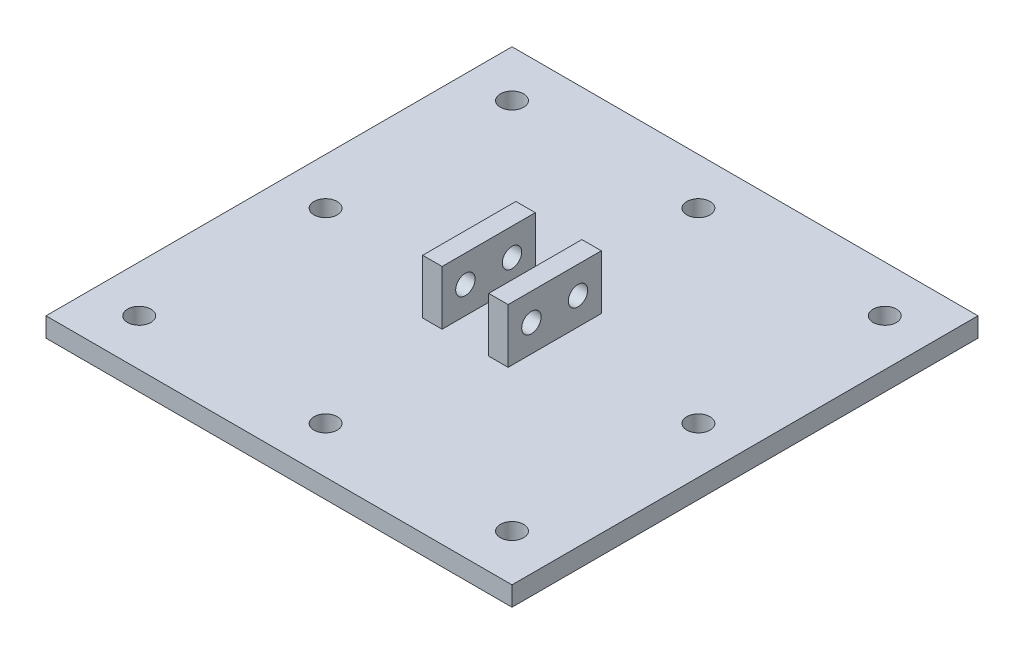
ISO-10303-21;
HEADER;
FILE_DESCRIPTION(('STEP AP214'),'2;1');
FILE_NAME('part.step','',(''),(''),'','','');
FILE_SCHEMA(('AUTOMOTIVE_DESIGN { 1 0 10303 214 1 1 1 1 }'));
ENDSEC;
DATA;
#1=APPLICATION_CONTEXT('core data for automotive mechanical design processes');
#2=APPLICATION_PROTOCOL_DEFINITION('international standard','automotive_design',2000,#1);
#3=PRODUCT_CONTEXT('',#1,'mechanical');
#4=PRODUCT('Part','Part','',(#3));
#5=PRODUCT_RELATED_PRODUCT_CATEGORY('part','',(#4));
#6=PRODUCT_DEFINITION_FORMATION('','',#4);
#7=PRODUCT_DEFINITION_CONTEXT('part definition',#1,'design');
#8=PRODUCT_DEFINITION('design','',#6,#7);
#9=PRODUCT_DEFINITION_SHAPE('','',#8);
#10=(LENGTH_UNIT() NAMED_UNIT(*) SI_UNIT(.MILLI.,.METRE.));
#11=(NAMED_UNIT(*) PLANE_ANGLE_UNIT() SI_UNIT($,.RADIAN.));
#12=(NAMED_UNIT(*) SI_UNIT($,.STERADIAN.) SOLID_ANGLE_UNIT());
#13=UNCERTAINTY_MEASURE_WITH_UNIT(LENGTH_MEASURE(1.E-05),#10,'distance_accuracy_value','');
#14=(GEOMETRIC_REPRESENTATION_CONTEXT(3) GLOBAL_UNCERTAINTY_ASSIGNED_CONTEXT((#13)) GLOBAL_UNIT_ASSIGNED_CONTEXT((#10,
#11,#12)) REPRESENTATION_CONTEXT('',''));
#15=CARTESIAN_POINT('',(0.,0.,0.));
#16=DIRECTION('',(0.,0.,1.));
#17=DIRECTION('',(1.,0.,0.));
#18=AXIS2_PLACEMENT_3D('',#15,#16,#17);
#19=CARTESIAN_POINT('',(0.,2.5,0.));
#20=DIRECTION('',(0.,-1.,0.));
#21=DIRECTION('',(0.,0.,-1.));
#22=AXIS2_PLACEMENT_3D('',#19,#20,#21);
#23=PLANE('',#22);
#24=CARTESIAN_POINT('',(-24.,2.5,24.));
#25=DIRECTION('',(0.,1.,0.));
#26=DIRECTION('',(0.,0.,1.));
#27=AXIS2_PLACEMENT_3D('',#24,#25,#26);
#28=CIRCLE('',#27,1.5);
#29=CARTESIAN_POINT('',(-24.,2.5,25.5));
#30=VERTEX_POINT('',#29);
#31=EDGE_CURVE('E507',#30,#30,#28,.T.);
#32=ORIENTED_EDGE('',*,*,#31,.F.);
#33=EDGE_LOOP('',(#32));
#34=FACE_BOUND('',#33,.T.);
#35=CARTESIAN_POINT('',(-24.,2.5,-24.));
#36=DIRECTION('',(0.,1.,0.));
#37=DIRECTION('',(0.,0.,1.));
#38=AXIS2_PLACEMENT_3D('',#35,#36,#37);
#39=CIRCLE('',#38,1.5);
#40=CARTESIAN_POINT('',(-24.,2.5,-22.5));
#41=VERTEX_POINT('',#40);
#42=EDGE_CURVE('E511',#41,#41,#39,.T.);
#43=ORIENTED_EDGE('',*,*,#42,.F.);
#44=EDGE_LOOP('',(#43));
#45=FACE_BOUND('',#44,.T.);
#46=CARTESIAN_POINT('',(24.,2.5,-24.));
#47=DIRECTION('',(0.,1.,0.));
#48=DIRECTION('',(0.,0.,1.));
#49=AXIS2_PLACEMENT_3D('',#46,#47,#48);
#50=CIRCLE('',#49,1.5);
#51=CARTESIAN_POINT('',(24.,2.5,-22.5));
#52=VERTEX_POINT('',#51);
#53=EDGE_CURVE('E522',#52,#52,#50,.T.);
#54=ORIENTED_EDGE('',*,*,#53,.F.);
#55=EDGE_LOOP('',(#54));
#56=FACE_BOUND('',#55,.T.);
#57=CARTESIAN_POINT('',(24.,2.5,0.));
#58=DIRECTION('',(0.,1.,0.));
#59=DIRECTION('',(0.,0.,1.));
#60=AXIS2_PLACEMENT_3D('',#57,#58,#59);
#61=CIRCLE('',#60,1.5);
#62=CARTESIAN_POINT('',(24.,2.5,1.5));
#63=VERTEX_POINT('',#62);
#64=EDGE_CURVE('E528',#63,#63,#61,.T.);
#65=ORIENTED_EDGE('',*,*,#64,.F.);
#66=EDGE_LOOP('',(#65));
#67=FACE_BOUND('',#66,.T.);
#68=CARTESIAN_POINT('',(-24.,2.5,0.));
#69=DIRECTION('',(0.,1.,0.));
#70=DIRECTION('',(0.,0.,1.));
#71=AXIS2_PLACEMENT_3D('',#68,#69,#70);
#72=CIRCLE('',#71,1.5);
#73=CARTESIAN_POINT('',(-24.,2.5,1.5));
#74=VERTEX_POINT('',#73);
#75=EDGE_CURVE('E534',#74,#74,#72,.T.);
#76=ORIENTED_EDGE('',*,*,#75,.F.);
#77=EDGE_LOOP('',(#76));
#78=FACE_BOUND('',#77,.T.);
#79=CARTESIAN_POINT('',(0.,2.5,24.));
#80=DIRECTION('',(0.,1.,0.));
#81=DIRECTION('',(0.,0.,1.));
#82=AXIS2_PLACEMENT_3D('',#79,#80,#81);
#83=CIRCLE('',#82,1.5);
#84=CARTESIAN_POINT('',(0.,2.5,25.5));
#85=VERTEX_POINT('',#84);
#86=EDGE_CURVE('E557',#85,#85,#83,.T.);
#87=ORIENTED_EDGE('',*,*,#86,.F.);
#88=EDGE_LOOP('',(#87));
#89=FACE_BOUND('',#88,.T.);
#90=CARTESIAN_POINT('',(0.,2.5,-24.));
#91=DIRECTION('',(0.,1.,0.));
#92=DIRECTION('',(0.,0.,1.));
#93=AXIS2_PLACEMENT_3D('',#90,#91,#92);
#94=CIRCLE('',#93,1.5);
#95=CARTESIAN_POINT('',(0.,2.5,-22.5));
#96=VERTEX_POINT('',#95);
#97=EDGE_CURVE('E564',#96,#96,#94,.T.);
#98=ORIENTED_EDGE('',*,*,#97,.F.);
#99=EDGE_LOOP('',(#98));
#100=FACE_BOUND('',#99,.T.);
#101=CARTESIAN_POINT('',(24.,2.5,24.));
#102=DIRECTION('',(0.,1.,0.));
#103=DIRECTION('',(0.,0.,1.));
#104=AXIS2_PLACEMENT_3D('',#101,#102,#103);
#105=CIRCLE('',#104,1.5);
#106=CARTESIAN_POINT('',(24.,2.5,25.5));
#107=VERTEX_POINT('',#106);
#108=EDGE_CURVE('E233',#107,#107,#105,.T.);
#109=ORIENTED_EDGE('',*,*,#108,.F.);
#110=EDGE_LOOP('',(#109));
#111=FACE_BOUND('',#110,.T.);
#112=DIRECTION('',(0.,0.,-1.));
#113=VECTOR('',#112,1.);
#114=CARTESIAN_POINT('',(-3.,2.5,6.));
#115=LINE('',#114,#113);
#116=CARTESIAN_POINT('',(-3.,2.5,6.));
#117=VERTEX_POINT('',#116);
#118=CARTESIAN_POINT('',(-3.,2.5,-6.));
#119=VERTEX_POINT('',#118);
#120=EDGE_CURVE('E149',#117,#119,#115,.T.);
#121=ORIENTED_EDGE('',*,*,#120,.F.);
#122=DIRECTION('',(1.,0.,0.));
#123=VECTOR('',#122,1.);
#124=CARTESIAN_POINT('',(-5.5,2.5,6.));
#125=LINE('',#124,#123);
#126=CARTESIAN_POINT('',(-5.5,2.5,6.));
#127=VERTEX_POINT('',#126);
#128=EDGE_CURVE('E162',#127,#117,#125,.T.);
#129=ORIENTED_EDGE('',*,*,#128,.F.);
#130=DIRECTION('',(0.,0.,1.));
#131=VECTOR('',#130,1.);
#132=CARTESIAN_POINT('',(-5.5,2.5,6.));
#133=LINE('',#132,#131);
#134=CARTESIAN_POINT('',(-5.5,2.5,-6.));
#135=VERTEX_POINT('',#134);
#136=EDGE_CURVE('E171',#135,#127,#133,.T.);
#137=ORIENTED_EDGE('',*,*,#136,.F.);
#138=DIRECTION('',(-1.,0.,0.));
#139=VECTOR('',#138,1.);
#140=CARTESIAN_POINT('',(-5.5,2.5,-6.));
#141=LINE('',#140,#139);
#142=EDGE_CURVE('E152',#119,#135,#141,.T.);
#143=ORIENTED_EDGE('',*,*,#142,.F.);
#144=EDGE_LOOP('',(#121,#129,#137,#143));
#145=FACE_BOUND('',#144,.T.);
#146=DIRECTION('',(0.,0.,-1.));
#147=VECTOR('',#146,1.);
#148=CARTESIAN_POINT('',(30.,2.5,30.));
#149=LINE('',#148,#147);
#150=CARTESIAN_POINT('',(30.,2.5,30.));
#151=VERTEX_POINT('',#150);
#152=CARTESIAN_POINT('',(30.,2.5,-30.));
#153=VERTEX_POINT('',#152);
#154=EDGE_CURVE('E188',#151,#153,#149,.T.);
#155=ORIENTED_EDGE('',*,*,#154,.T.);
#156=DIRECTION('',(-1.,0.,0.));
#157=VECTOR('',#156,1.);
#158=CARTESIAN_POINT('',(-30.,2.5,-30.));
#159=LINE('',#158,#157);
#160=CARTESIAN_POINT('',(-30.,2.5,-30.));
#161=VERTEX_POINT('',#160);
#162=EDGE_CURVE('E191',#153,#161,#159,.T.);
#163=ORIENTED_EDGE('',*,*,#162,.T.);
#164=DIRECTION('',(0.,0.,1.));
#165=VECTOR('',#164,1.);
#166=CARTESIAN_POINT('',(-30.,2.5,30.));
#167=LINE('',#166,#165);
#168=CARTESIAN_POINT('',(-30.,2.5,30.));
#169=VERTEX_POINT('',#168);
#170=EDGE_CURVE('E194',#161,#169,#167,.T.);
#171=ORIENTED_EDGE('',*,*,#170,.T.);
#172=DIRECTION('',(1.,0.,0.));
#173=VECTOR('',#172,1.);
#174=CARTESIAN_POINT('',(-30.,2.5,30.));
#175=LINE('',#174,#173);
#176=EDGE_CURVE('E196',#169,#151,#175,.T.);
#177=ORIENTED_EDGE('',*,*,#176,.T.);
#178=EDGE_LOOP('',(#155,#163,#171,#177));
#179=FACE_BOUND('',#178,.T.);
#180=DIRECTION('',(0.,0.,-1.));
#181=VECTOR('',#180,1.);
#182=CARTESIAN_POINT('',(5.5,2.5,6.));
#183=LINE('',#182,#181);
#184=CARTESIAN_POINT('',(5.5,2.5,6.));
#185=VERTEX_POINT('',#184);
#186=CARTESIAN_POINT('',(5.5,2.5,-6.));
#187=VERTEX_POINT('',#186);
#188=EDGE_CURVE('E148',#185,#187,#183,.T.);
#189=ORIENTED_EDGE('',*,*,#188,.F.);
#190=DIRECTION('',(1.,0.,0.));
#191=VECTOR('',#190,1.);
#192=CARTESIAN_POINT('',(3.,2.5,6.));
#193=LINE('',#192,#191);
#194=CARTESIAN_POINT('',(3.,2.5,6.));
#195=VERTEX_POINT('',#194);
#196=EDGE_CURVE('E145',#195,#185,#193,.T.);
#197=ORIENTED_EDGE('',*,*,#196,.F.);
#198=DIRECTION('',(0.,0.,1.));
#199=VECTOR('',#198,1.);
#200=CARTESIAN_POINT('',(3.,2.5,6.));
#201=LINE('',#200,#199);
#202=CARTESIAN_POINT('',(3.,2.5,-6.));
#203=VERTEX_POINT('',#202);
#204=EDGE_CURVE('E59',#203,#195,#201,.T.);
#205=ORIENTED_EDGE('',*,*,#204,.F.);
#206=DIRECTION('',(-1.,0.,0.));
#207=VECTOR('',#206,1.);
#208=CARTESIAN_POINT('',(3.,2.5,-6.));
#209=LINE('',#208,#207);
#210=EDGE_CURVE('E54',#187,#203,#209,.T.);
#211=ORIENTED_EDGE('',*,*,#210,.F.);
#212=EDGE_LOOP('',(#189,#197,#205,#211));
#213=FACE_BOUND('',#212,.T.);
#214=ADVANCED_FACE('F37',(#34,#45,#56,#67,#78,#89,#100,#111,#145,#179,#213),#23,.F.);
#215=CARTESIAN_POINT('',(30.,2.5,30.));
#216=DIRECTION('',(-1.,0.,0.));
#217=DIRECTION('',(0.,0.,1.));
#218=AXIS2_PLACEMENT_3D('',#215,#216,#217);
#219=PLANE('',#218);
#220=DIRECTION('',(0.,0.,-1.));
#221=VECTOR('',#220,1.);
#222=CARTESIAN_POINT('',(30.,0.,30.));
#223=LINE('',#222,#221);
#224=CARTESIAN_POINT('',(30.,0.,30.));
#225=VERTEX_POINT('',#224);
#226=CARTESIAN_POINT('',(30.,0.,-30.));
#227=VERTEX_POINT('',#226);
#228=EDGE_CURVE('E187',#225,#227,#223,.T.);
#229=ORIENTED_EDGE('',*,*,#228,.T.);
#230=DIRECTION('',(0.,-1.,0.));
#231=VECTOR('',#230,1.);
#232=CARTESIAN_POINT('',(30.,2.5,-30.));
#233=LINE('',#232,#231);
#234=EDGE_CURVE('E11',#153,#227,#233,.T.);
#235=ORIENTED_EDGE('',*,*,#234,.F.);
#236=ORIENTED_EDGE('',*,*,#154,.F.);
#237=DIRECTION('',(0.,-1.,0.));
#238=VECTOR('',#237,1.);
#239=CARTESIAN_POINT('',(30.,2.5,30.));
#240=LINE('',#239,#238);
#241=EDGE_CURVE('E198',#151,#225,#240,.T.);
#242=ORIENTED_EDGE('',*,*,#241,.T.);
#243=EDGE_LOOP('',(#229,#235,#236,#242));
#244=FACE_BOUND('',#243,.T.);
#245=ADVANCED_FACE('F39',(#244),#219,.F.);
#246=CARTESIAN_POINT('',(-30.,2.5,-30.));
#247=DIRECTION('',(0.,0.,1.));
#248=DIRECTION('',(1.,0.,0.));
#249=AXIS2_PLACEMENT_3D('',#246,#247,#248);
#250=PLANE('',#249);
#251=DIRECTION('',(-1.,0.,0.));
#252=VECTOR('',#251,1.);
#253=CARTESIAN_POINT('',(-30.,0.,-30.));
#254=LINE('',#253,#252);
#255=CARTESIAN_POINT('',(-30.,0.,-30.));
#256=VERTEX_POINT('',#255);
#257=EDGE_CURVE('E201',#227,#256,#254,.T.);
#258=ORIENTED_EDGE('',*,*,#257,.T.);
#259=DIRECTION('',(0.,-1.,0.));
#260=VECTOR('',#259,1.);
#261=CARTESIAN_POINT('',(-30.,2.5,-30.));
#262=LINE('',#261,#260);
#263=EDGE_CURVE('E46',#161,#256,#262,.T.);
#264=ORIENTED_EDGE('',*,*,#263,.F.);
#265=ORIENTED_EDGE('',*,*,#162,.F.);
#266=ORIENTED_EDGE('',*,*,#234,.T.);
#267=EDGE_LOOP('',(#258,#264,#265,#266));
#268=FACE_BOUND('',#267,.T.);
#269=ADVANCED_FACE('F269',(#268),#250,.F.);
#270=CARTESIAN_POINT('',(-30.,2.5,30.));
#271=DIRECTION('',(1.,0.,0.));
#272=DIRECTION('',(0.,0.,-1.));
#273=AXIS2_PLACEMENT_3D('',#270,#271,#272);
#274=PLANE('',#273);
#275=DIRECTION('',(0.,0.,1.));
#276=VECTOR('',#275,1.);
#277=CARTESIAN_POINT('',(-30.,0.,30.));
#278=LINE('',#277,#276);
#279=CARTESIAN_POINT('',(-30.,0.,30.));
#280=VERTEX_POINT('',#279);
#281=EDGE_CURVE('E203',#256,#280,#278,.T.);
#282=ORIENTED_EDGE('',*,*,#281,.T.);
#283=DIRECTION('',(0.,-1.,0.));
#284=VECTOR('',#283,1.);
#285=CARTESIAN_POINT('',(-30.,2.5,30.));
#286=LINE('',#285,#284);
#287=EDGE_CURVE('E208',#169,#280,#286,.T.);
#288=ORIENTED_EDGE('',*,*,#287,.F.);
#289=ORIENTED_EDGE('',*,*,#170,.F.);
#290=ORIENTED_EDGE('',*,*,#263,.T.);
#291=EDGE_LOOP('',(#282,#288,#289,#290));
#292=FACE_BOUND('',#291,.T.);
#293=ADVANCED_FACE('F284',(#292),#274,.F.);
#294=CARTESIAN_POINT('',(-30.,2.5,30.));
#295=DIRECTION('',(0.,0.,-1.));
#296=DIRECTION('',(-1.,0.,0.));
#297=AXIS2_PLACEMENT_3D('',#294,#295,#296);
#298=PLANE('',#297);
#299=DIRECTION('',(1.,0.,0.));
#300=VECTOR('',#299,1.);
#301=CARTESIAN_POINT('',(-30.,0.,30.));
#302=LINE('',#301,#300);
#303=EDGE_CURVE('E192',#280,#225,#302,.T.);
#304=ORIENTED_EDGE('',*,*,#303,.T.);
#305=ORIENTED_EDGE('',*,*,#241,.F.);
#306=ORIENTED_EDGE('',*,*,#176,.F.);
#307=ORIENTED_EDGE('',*,*,#287,.T.);
#308=EDGE_LOOP('',(#304,#305,#306,#307));
#309=FACE_BOUND('',#308,.T.);
#310=ADVANCED_FACE('F280',(#309),#298,.F.);
#311=CARTESIAN_POINT('',(0.,0.,0.));
#312=DIRECTION('',(0.,-1.,0.));
#313=DIRECTION('',(0.,0.,-1.));
#314=AXIS2_PLACEMENT_3D('',#311,#312,#313);
#315=PLANE('',#314);
#316=CARTESIAN_POINT('',(-24.,0.,24.));
#317=DIRECTION('',(0.,-1.,0.));
#318=DIRECTION('',(0.,0.,-1.));
#319=AXIS2_PLACEMENT_3D('',#316,#317,#318);
#320=CIRCLE('',#319,1.5);
#321=CARTESIAN_POINT('',(-24.,0.,22.5));
#322=VERTEX_POINT('',#321);
#323=EDGE_CURVE('E505',#322,#322,#320,.F.);
#324=ORIENTED_EDGE('',*,*,#323,.T.);
#325=EDGE_LOOP('',(#324));
#326=FACE_BOUND('',#325,.T.);
#327=CARTESIAN_POINT('',(-24.,0.,-24.));
#328=DIRECTION('',(0.,-1.,0.));
#329=DIRECTION('',(0.,0.,-1.));
#330=AXIS2_PLACEMENT_3D('',#327,#328,#329);
#331=CIRCLE('',#330,1.5);
#332=CARTESIAN_POINT('',(-24.,0.,-25.5));
#333=VERTEX_POINT('',#332);
#334=EDGE_CURVE('E519',#333,#333,#331,.F.);
#335=ORIENTED_EDGE('',*,*,#334,.T.);
#336=EDGE_LOOP('',(#335));
#337=FACE_BOUND('',#336,.T.);
#338=CARTESIAN_POINT('',(24.,0.,-24.));
#339=DIRECTION('',(0.,-1.,0.));
#340=DIRECTION('',(0.,0.,-1.));
#341=AXIS2_PLACEMENT_3D('',#338,#339,#340);
#342=CIRCLE('',#341,1.5);
#343=CARTESIAN_POINT('',(24.,0.,-25.5));
#344=VERTEX_POINT('',#343);
#345=EDGE_CURVE('E525',#344,#344,#342,.F.);
#346=ORIENTED_EDGE('',*,*,#345,.T.);
#347=EDGE_LOOP('',(#346));
#348=FACE_BOUND('',#347,.T.);
#349=CARTESIAN_POINT('',(24.,0.,0.));
#350=DIRECTION('',(0.,-1.,0.));
#351=DIRECTION('',(0.,0.,-1.));
#352=AXIS2_PLACEMENT_3D('',#349,#350,#351);
#353=CIRCLE('',#352,1.5);
#354=CARTESIAN_POINT('',(24.,0.,-1.5));
#355=VERTEX_POINT('',#354);
#356=EDGE_CURVE('E531',#355,#355,#353,.F.);
#357=ORIENTED_EDGE('',*,*,#356,.T.);
#358=EDGE_LOOP('',(#357));
#359=FACE_BOUND('',#358,.T.);
#360=CARTESIAN_POINT('',(-24.,0.,0.));
#361=DIRECTION('',(0.,-1.,0.));
#362=DIRECTION('',(0.,0.,-1.));
#363=AXIS2_PLACEMENT_3D('',#360,#361,#362);
#364=CIRCLE('',#363,1.5);
#365=CARTESIAN_POINT('',(-24.,0.,-1.5));
#366=VERTEX_POINT('',#365);
#367=EDGE_CURVE('E552',#366,#366,#364,.F.);
#368=ORIENTED_EDGE('',*,*,#367,.T.);
#369=EDGE_LOOP('',(#368));
#370=FACE_BOUND('',#369,.T.);
#371=CARTESIAN_POINT('',(0.,0.,24.));
#372=DIRECTION('',(0.,-1.,0.));
#373=DIRECTION('',(0.,0.,-1.));
#374=AXIS2_PLACEMENT_3D('',#371,#372,#373);
#375=CIRCLE('',#374,1.5);
#376=CARTESIAN_POINT('',(0.,0.,22.5));
#377=VERTEX_POINT('',#376);
#378=EDGE_CURVE('E562',#377,#377,#375,.F.);
#379=ORIENTED_EDGE('',*,*,#378,.T.);
#380=EDGE_LOOP('',(#379));
#381=FACE_BOUND('',#380,.T.);
#382=CARTESIAN_POINT('',(0.,0.,-24.));
#383=DIRECTION('',(0.,-1.,0.));
#384=DIRECTION('',(0.,0.,-1.));
#385=AXIS2_PLACEMENT_3D('',#382,#383,#384);
#386=CIRCLE('',#385,1.5);
#387=CARTESIAN_POINT('',(0.,0.,-25.5));
#388=VERTEX_POINT('',#387);
#389=EDGE_CURVE('E514',#388,#388,#386,.F.);
#390=ORIENTED_EDGE('',*,*,#389,.T.);
#391=EDGE_LOOP('',(#390));
#392=FACE_BOUND('',#391,.T.);
#393=CARTESIAN_POINT('',(24.,0.,24.));
#394=DIRECTION('',(0.,-1.,0.));
#395=DIRECTION('',(0.,0.,-1.));
#396=AXIS2_PLACEMENT_3D('',#393,#394,#395);
#397=CIRCLE('',#396,1.5);
#398=CARTESIAN_POINT('',(24.,0.,22.5));
#399=VERTEX_POINT('',#398);
#400=EDGE_CURVE('E508',#399,#399,#397,.F.);
#401=ORIENTED_EDGE('',*,*,#400,.T.);
#402=EDGE_LOOP('',(#401));
#403=FACE_BOUND('',#402,.T.);
#404=ORIENTED_EDGE('',*,*,#228,.F.);
#405=ORIENTED_EDGE('',*,*,#303,.F.);
#406=ORIENTED_EDGE('',*,*,#281,.F.);
#407=ORIENTED_EDGE('',*,*,#257,.F.);
#408=EDGE_LOOP('',(#404,#405,#406,#407));
#409=FACE_BOUND('',#408,.T.);
#410=ADVANCED_FACE('F277',(#326,#337,#348,#359,#370,#381,#392,#403,#409),#315,.T.);
#411=CARTESIAN_POINT('',(-3.,9.5,6.));
#412=DIRECTION('',(-1.,0.,0.));
#413=DIRECTION('',(0.,0.,1.));
#414=AXIS2_PLACEMENT_3D('',#411,#412,#413);
#415=PLANE('',#414);
#416=CARTESIAN_POINT('',(-3.,6.,-3.));
#417=DIRECTION('',(-1.,0.,0.));
#418=DIRECTION('',(0.,0.,1.));
#419=AXIS2_PLACEMENT_3D('',#416,#417,#418);
#420=CIRCLE('',#419,1.25);
#421=CARTESIAN_POINT('',(-3.,6.,-1.75));
#422=VERTEX_POINT('',#421);
#423=EDGE_CURVE('E236',#422,#422,#420,.T.);
#424=ORIENTED_EDGE('',*,*,#423,.T.);
#425=EDGE_LOOP('',(#424));
#426=FACE_BOUND('',#425,.T.);
#427=CARTESIAN_POINT('',(-3.,6.,3.));
#428=DIRECTION('',(-1.,0.,0.));
#429=DIRECTION('',(0.,0.,1.));
#430=AXIS2_PLACEMENT_3D('',#427,#428,#429);
#431=CIRCLE('',#430,1.25);
#432=CARTESIAN_POINT('',(-3.,6.,4.25));
#433=VERTEX_POINT('',#432);
#434=EDGE_CURVE('E214',#433,#433,#431,.T.);
#435=ORIENTED_EDGE('',*,*,#434,.T.);
#436=EDGE_LOOP('',(#435));
#437=FACE_BOUND('',#436,.T.);
#438=ORIENTED_EDGE('',*,*,#120,.T.);
#439=DIRECTION('',(0.,-1.,0.));
#440=VECTOR('',#439,1.);
#441=CARTESIAN_POINT('',(-3.,9.5,-6.));
#442=LINE('',#441,#440);
#443=CARTESIAN_POINT('',(-3.,9.5,-6.));
#444=VERTEX_POINT('',#443);
#445=EDGE_CURVE('E184',#444,#119,#442,.T.);
#446=ORIENTED_EDGE('',*,*,#445,.F.);
#447=DIRECTION('',(0.,0.,-1.));
#448=VECTOR('',#447,1.);
#449=CARTESIAN_POINT('',(-3.,9.5,6.));
#450=LINE('',#449,#448);
#451=CARTESIAN_POINT('',(-3.,9.5,6.));
#452=VERTEX_POINT('',#451);
#453=EDGE_CURVE('E158',#452,#444,#450,.T.);
#454=ORIENTED_EDGE('',*,*,#453,.F.);
#455=DIRECTION('',(0.,-1.,0.));
#456=VECTOR('',#455,1.);
#457=CARTESIAN_POINT('',(-3.,9.5,6.));
#458=LINE('',#457,#456);
#459=EDGE_CURVE('E167',#452,#117,#458,.T.);
#460=ORIENTED_EDGE('',*,*,#459,.T.);
#461=EDGE_LOOP('',(#438,#446,#454,#460));
#462=FACE_BOUND('',#461,.T.);
#463=ADVANCED_FACE('F275',(#426,#437,#462),#415,.F.);
#464=CARTESIAN_POINT('',(-5.5,9.5,-6.));
#465=DIRECTION('',(0.,0.,1.));
#466=DIRECTION('',(1.,0.,0.));
#467=AXIS2_PLACEMENT_3D('',#464,#465,#466);
#468=PLANE('',#467);
#469=ORIENTED_EDGE('',*,*,#142,.T.);
#470=DIRECTION('',(0.,-1.,0.));
#471=VECTOR('',#470,1.);
#472=CARTESIAN_POINT('',(-5.5,9.5,-6.));
#473=LINE('',#472,#471);
#474=CARTESIAN_POINT('',(-5.5,9.5,-6.));
#475=VERTEX_POINT('',#474);
#476=EDGE_CURVE('E181',#475,#135,#473,.T.);
#477=ORIENTED_EDGE('',*,*,#476,.F.);
#478=DIRECTION('',(-1.,0.,0.));
#479=VECTOR('',#478,1.);
#480=CARTESIAN_POINT('',(-5.5,9.5,-6.));
#481=LINE('',#480,#479);
#482=EDGE_CURVE('E161',#444,#475,#481,.T.);
#483=ORIENTED_EDGE('',*,*,#482,.F.);
#484=ORIENTED_EDGE('',*,*,#445,.T.);
#485=EDGE_LOOP('',(#469,#477,#483,#484));
#486=FACE_BOUND('',#485,.T.);
#487=ADVANCED_FACE('F326',(#486),#468,.F.);
#488=CARTESIAN_POINT('',(-5.5,9.5,6.));
#489=DIRECTION('',(1.,0.,0.));
#490=DIRECTION('',(0.,0.,-1.));
#491=AXIS2_PLACEMENT_3D('',#488,#489,#490);
#492=PLANE('',#491);
#493=CARTESIAN_POINT('',(-5.5,6.,-3.));
#494=DIRECTION('',(-1.,0.,0.));
#495=DIRECTION('',(0.,0.,1.));
#496=AXIS2_PLACEMENT_3D('',#493,#494,#495);
#497=CIRCLE('',#496,1.25);
#498=CARTESIAN_POINT('',(-5.5,6.,-1.75));
#499=VERTEX_POINT('',#498);
#500=EDGE_CURVE('E221',#499,#499,#497,.T.);
#501=ORIENTED_EDGE('',*,*,#500,.F.);
#502=EDGE_LOOP('',(#501));
#503=FACE_BOUND('',#502,.T.);
#504=CARTESIAN_POINT('',(-5.5,6.,3.));
#505=DIRECTION('',(-1.,0.,0.));
#506=DIRECTION('',(0.,0.,1.));
#507=AXIS2_PLACEMENT_3D('',#504,#505,#506);
#508=CIRCLE('',#507,1.25);
#509=CARTESIAN_POINT('',(-5.5,6.,4.25));
#510=VERTEX_POINT('',#509);
#511=EDGE_CURVE('E230',#510,#510,#508,.T.);
#512=ORIENTED_EDGE('',*,*,#511,.F.);
#513=EDGE_LOOP('',(#512));
#514=FACE_BOUND('',#513,.T.);
#515=ORIENTED_EDGE('',*,*,#136,.T.);
#516=DIRECTION('',(0.,-1.,0.));
#517=VECTOR('',#516,1.);
#518=CARTESIAN_POINT('',(-5.5,9.5,6.));
#519=LINE('',#518,#517);
#520=CARTESIAN_POINT('',(-5.5,9.5,6.));
#521=VERTEX_POINT('',#520);
#522=EDGE_CURVE('E178',#521,#127,#519,.T.);
#523=ORIENTED_EDGE('',*,*,#522,.F.);
#524=DIRECTION('',(0.,0.,1.));
#525=VECTOR('',#524,1.);
#526=CARTESIAN_POINT('',(-5.5,9.5,6.));
#527=LINE('',#526,#525);
#528=EDGE_CURVE('E164',#475,#521,#527,.T.);
#529=ORIENTED_EDGE('',*,*,#528,.F.);
#530=ORIENTED_EDGE('',*,*,#476,.T.);
#531=EDGE_LOOP('',(#515,#523,#529,#530));
#532=FACE_BOUND('',#531,.T.);
#533=ADVANCED_FACE('F334',(#503,#514,#532),#492,.F.);
#534=CARTESIAN_POINT('',(-5.5,9.5,6.));
#535=DIRECTION('',(0.,0.,-1.));
#536=DIRECTION('',(-1.,0.,0.));
#537=AXIS2_PLACEMENT_3D('',#534,#535,#536);
#538=PLANE('',#537);
#539=ORIENTED_EDGE('',*,*,#128,.T.);
#540=ORIENTED_EDGE('',*,*,#459,.F.);
#541=DIRECTION('',(1.,0.,0.));
#542=VECTOR('',#541,1.);
#543=CARTESIAN_POINT('',(-5.5,9.5,6.));
#544=LINE('',#543,#542);
#545=EDGE_CURVE('E166',#521,#452,#544,.T.);
#546=ORIENTED_EDGE('',*,*,#545,.F.);
#547=ORIENTED_EDGE('',*,*,#522,.T.);
#548=EDGE_LOOP('',(#539,#540,#546,#547));
#549=FACE_BOUND('',#548,.T.);
#550=ADVANCED_FACE('F341',(#549),#538,.F.);
#551=CARTESIAN_POINT('',(0.,9.5,0.));
#552=DIRECTION('',(0.,-1.,0.));
#553=DIRECTION('',(0.,0.,-1.));
#554=AXIS2_PLACEMENT_3D('',#551,#552,#553);
#555=PLANE('',#554);
#556=ORIENTED_EDGE('',*,*,#453,.T.);
#557=ORIENTED_EDGE('',*,*,#482,.T.);
#558=ORIENTED_EDGE('',*,*,#528,.T.);
#559=ORIENTED_EDGE('',*,*,#545,.T.);
#560=EDGE_LOOP('',(#556,#557,#558,#559));
#561=FACE_BOUND('',#560,.T.);
#562=ADVANCED_FACE('F349',(#561),#555,.F.);
#563=CARTESIAN_POINT('',(5.5,9.5,6.));
#564=DIRECTION('',(-1.,0.,0.));
#565=DIRECTION('',(0.,0.,1.));
#566=AXIS2_PLACEMENT_3D('',#563,#564,#565);
#567=PLANE('',#566);
#568=CARTESIAN_POINT('',(5.5,6.,-3.));
#569=DIRECTION('',(-1.,0.,0.));
#570=DIRECTION('',(0.,0.,1.));
#571=AXIS2_PLACEMENT_3D('',#568,#569,#570);
#572=CIRCLE('',#571,1.25);
#573=CARTESIAN_POINT('',(5.5,6.,-1.75));
#574=VERTEX_POINT('',#573);
#575=EDGE_CURVE('E215',#574,#574,#572,.F.);
#576=ORIENTED_EDGE('',*,*,#575,.F.);
#577=EDGE_LOOP('',(#576));
#578=FACE_BOUND('',#577,.T.);
#579=CARTESIAN_POINT('',(5.5,6.,3.));
#580=DIRECTION('',(-1.,0.,0.));
#581=DIRECTION('',(0.,0.,1.));
#582=AXIS2_PLACEMENT_3D('',#579,#580,#581);
#583=CIRCLE('',#582,1.25);
#584=CARTESIAN_POINT('',(5.5,6.,4.25));
#585=VERTEX_POINT('',#584);
#586=EDGE_CURVE('E226',#585,#585,#583,.F.);
#587=ORIENTED_EDGE('',*,*,#586,.F.);
#588=EDGE_LOOP('',(#587));
#589=FACE_BOUND('',#588,.T.);
#590=ORIENTED_EDGE('',*,*,#188,.T.);
#591=DIRECTION('',(0.,-1.,0.));
#592=VECTOR('',#591,1.);
#593=CARTESIAN_POINT('',(5.5,9.5,-6.));
#594=LINE('',#593,#592);
#595=CARTESIAN_POINT('',(5.5,9.5,-6.));
#596=VERTEX_POINT('',#595);
#597=EDGE_CURVE('E129',#596,#187,#594,.T.);
#598=ORIENTED_EDGE('',*,*,#597,.F.);
#599=DIRECTION('',(0.,0.,-1.));
#600=VECTOR('',#599,1.);
#601=CARTESIAN_POINT('',(5.5,9.5,6.));
#602=LINE('',#601,#600);
#603=CARTESIAN_POINT('',(5.5,9.5,6.));
#604=VERTEX_POINT('',#603);
#605=EDGE_CURVE('E136',#604,#596,#602,.T.);
#606=ORIENTED_EDGE('',*,*,#605,.F.);
#607=DIRECTION('',(0.,-1.,0.));
#608=VECTOR('',#607,1.);
#609=CARTESIAN_POINT('',(5.5,9.5,6.));
#610=LINE('',#609,#608);
#611=EDGE_CURVE('E241',#604,#185,#610,.T.);
#612=ORIENTED_EDGE('',*,*,#611,.T.);
#613=EDGE_LOOP('',(#590,#598,#606,#612));
#614=FACE_BOUND('',#613,.T.);
#615=ADVANCED_FACE('F147',(#578,#589,#614),#567,.F.);
#616=CARTESIAN_POINT('',(3.,9.5,-6.));
#617=DIRECTION('',(0.,0.,1.));
#618=DIRECTION('',(1.,0.,0.));
#619=AXIS2_PLACEMENT_3D('',#616,#617,#618);
#620=PLANE('',#619);
#621=ORIENTED_EDGE('',*,*,#210,.T.);
#622=DIRECTION('',(0.,-1.,0.));
#623=VECTOR('',#622,1.);
#624=CARTESIAN_POINT('',(3.,9.5,-6.));
#625=LINE('',#624,#623);
#626=CARTESIAN_POINT('',(3.,9.5,-6.));
#627=VERTEX_POINT('',#626);
#628=EDGE_CURVE('E132',#627,#203,#625,.T.);
#629=ORIENTED_EDGE('',*,*,#628,.F.);
#630=DIRECTION('',(-1.,0.,0.));
#631=VECTOR('',#630,1.);
#632=CARTESIAN_POINT('',(3.,9.5,-6.));
#633=LINE('',#632,#631);
#634=EDGE_CURVE('E125',#596,#627,#633,.T.);
#635=ORIENTED_EDGE('',*,*,#634,.F.);
#636=ORIENTED_EDGE('',*,*,#597,.T.);
#637=EDGE_LOOP('',(#621,#629,#635,#636));
#638=FACE_BOUND('',#637,.T.);
#639=ADVANCED_FACE('F127',(#638),#620,.F.);
#640=CARTESIAN_POINT('',(3.,9.5,6.));
#641=DIRECTION('',(1.,0.,0.));
#642=DIRECTION('',(0.,0.,-1.));
#643=AXIS2_PLACEMENT_3D('',#640,#641,#642);
#644=PLANE('',#643);
#645=CARTESIAN_POINT('',(3.,6.,-3.));
#646=DIRECTION('',(1.,0.,0.));
#647=DIRECTION('',(0.,0.,-1.));
#648=AXIS2_PLACEMENT_3D('',#645,#646,#647);
#649=CIRCLE('',#648,1.25);
#650=CARTESIAN_POINT('',(3.,6.,-4.25));
#651=VERTEX_POINT('',#650);
#652=EDGE_CURVE('E41',#651,#651,#649,.T.);
#653=ORIENTED_EDGE('',*,*,#652,.T.);
#654=EDGE_LOOP('',(#653));
#655=FACE_BOUND('',#654,.T.);
#656=CARTESIAN_POINT('',(3.,6.,3.));
#657=DIRECTION('',(1.,0.,0.));
#658=DIRECTION('',(0.,0.,-1.));
#659=AXIS2_PLACEMENT_3D('',#656,#657,#658);
#660=CIRCLE('',#659,1.25);
#661=CARTESIAN_POINT('',(3.,6.,1.75));
#662=VERTEX_POINT('',#661);
#663=EDGE_CURVE('E212',#662,#662,#660,.T.);
#664=ORIENTED_EDGE('',*,*,#663,.T.);
#665=EDGE_LOOP('',(#664));
#666=FACE_BOUND('',#665,.T.);
#667=ORIENTED_EDGE('',*,*,#204,.T.);
#668=DIRECTION('',(0.,-1.,0.));
#669=VECTOR('',#668,1.);
#670=CARTESIAN_POINT('',(3.,9.5,6.));
#671=LINE('',#670,#669);
#672=CARTESIAN_POINT('',(3.,9.5,6.));
#673=VERTEX_POINT('',#672);
#674=EDGE_CURVE('E154',#673,#195,#671,.T.);
#675=ORIENTED_EDGE('',*,*,#674,.F.);
#676=DIRECTION('',(0.,0.,1.));
#677=VECTOR('',#676,1.);
#678=CARTESIAN_POINT('',(3.,9.5,6.));
#679=LINE('',#678,#677);
#680=EDGE_CURVE('E135',#627,#673,#679,.T.);
#681=ORIENTED_EDGE('',*,*,#680,.F.);
#682=ORIENTED_EDGE('',*,*,#628,.T.);
#683=EDGE_LOOP('',(#667,#675,#681,#682));
#684=FACE_BOUND('',#683,.T.);
#685=ADVANCED_FACE('F252',(#655,#666,#684),#644,.F.);
#686=CARTESIAN_POINT('',(3.,9.5,6.));
#687=DIRECTION('',(0.,0.,-1.));
#688=DIRECTION('',(-1.,0.,0.));
#689=AXIS2_PLACEMENT_3D('',#686,#687,#688);
#690=PLANE('',#689);
#691=ORIENTED_EDGE('',*,*,#196,.T.);
#692=ORIENTED_EDGE('',*,*,#611,.F.);
#693=DIRECTION('',(1.,0.,0.));
#694=VECTOR('',#693,1.);
#695=CARTESIAN_POINT('',(3.,9.5,6.));
#696=LINE('',#695,#694);
#697=EDGE_CURVE('E141',#673,#604,#696,.T.);
#698=ORIENTED_EDGE('',*,*,#697,.F.);
#699=ORIENTED_EDGE('',*,*,#674,.T.);
#700=EDGE_LOOP('',(#691,#692,#698,#699));
#701=FACE_BOUND('',#700,.T.);
#702=ADVANCED_FACE('F250',(#701),#690,.F.);
#703=CARTESIAN_POINT('',(0.,9.5,0.));
#704=DIRECTION('',(0.,-1.,0.));
#705=DIRECTION('',(0.,0.,-1.));
#706=AXIS2_PLACEMENT_3D('',#703,#704,#705);
#707=PLANE('',#706);
#708=ORIENTED_EDGE('',*,*,#605,.T.);
#709=ORIENTED_EDGE('',*,*,#634,.T.);
#710=ORIENTED_EDGE('',*,*,#680,.T.);
#711=ORIENTED_EDGE('',*,*,#697,.T.);
#712=EDGE_LOOP('',(#708,#709,#710,#711));
#713=FACE_BOUND('',#712,.T.);
#714=ADVANCED_FACE('F139',(#713),#707,.F.);
#715=CARTESIAN_POINT('',(9.03553390593274,6.,3.));
#716=DIRECTION('',(-1.,0.,0.));
#717=DIRECTION('',(0.,0.,1.));
#718=AXIS2_PLACEMENT_3D('',#715,#716,#717);
#719=CYLINDRICAL_SURFACE('',#718,1.25);
#720=ORIENTED_EDGE('',*,*,#586,.T.);
#721=EDGE_LOOP('',(#720));
#722=FACE_BOUND('',#721,.T.);
#723=ORIENTED_EDGE('',*,*,#663,.F.);
#724=EDGE_LOOP('',(#723));
#725=FACE_BOUND('',#724,.T.);
#726=ADVANCED_FACE('F382',(#722,#725),#719,.F.);
#727=CARTESIAN_POINT('',(9.03553390593274,6.,-3.));
#728=DIRECTION('',(-1.,0.,0.));
#729=DIRECTION('',(0.,0.,1.));
#730=AXIS2_PLACEMENT_3D('',#727,#728,#729);
#731=CYLINDRICAL_SURFACE('',#730,1.25);
#732=ORIENTED_EDGE('',*,*,#575,.T.);
#733=EDGE_LOOP('',(#732));
#734=FACE_BOUND('',#733,.T.);
#735=ORIENTED_EDGE('',*,*,#652,.F.);
#736=EDGE_LOOP('',(#735));
#737=FACE_BOUND('',#736,.T.);
#738=ADVANCED_FACE('F392',(#734,#737),#731,.F.);
#739=ORIENTED_EDGE('',*,*,#511,.T.);
#740=EDGE_LOOP('',(#739));
#741=FACE_BOUND('',#740,.T.);
#742=ORIENTED_EDGE('',*,*,#434,.F.);
#743=EDGE_LOOP('',(#742));
#744=FACE_BOUND('',#743,.T.);
#745=ADVANCED_FACE('F395',(#741,#744),#719,.F.);
#746=ORIENTED_EDGE('',*,*,#500,.T.);
#747=EDGE_LOOP('',(#746));
#748=FACE_BOUND('',#747,.T.);
#749=ORIENTED_EDGE('',*,*,#423,.F.);
#750=EDGE_LOOP('',(#749));
#751=FACE_BOUND('',#750,.T.);
#752=ADVANCED_FACE('F401',(#748,#751),#731,.F.);
#753=CARTESIAN_POINT('',(24.,-0.00100000000000013,24.));
#754=DIRECTION('',(0.,1.,0.));
#755=DIRECTION('',(0.,0.,1.));
#756=AXIS2_PLACEMENT_3D('',#753,#754,#755);
#757=CYLINDRICAL_SURFACE('',#756,1.5);
#758=ORIENTED_EDGE('',*,*,#400,.F.);
#759=EDGE_LOOP('',(#758));
#760=FACE_BOUND('',#759,.T.);
#761=ORIENTED_EDGE('',*,*,#108,.T.);
#762=EDGE_LOOP('',(#761));
#763=FACE_BOUND('',#762,.T.);
#764=ADVANCED_FACE('F413',(#760,#763),#757,.F.);
#765=CARTESIAN_POINT('',(0.,-0.00100000000000013,-24.));
#766=DIRECTION('',(0.,1.,0.));
#767=DIRECTION('',(0.,0.,1.));
#768=AXIS2_PLACEMENT_3D('',#765,#766,#767);
#769=CYLINDRICAL_SURFACE('',#768,1.5);
#770=ORIENTED_EDGE('',*,*,#389,.F.);
#771=EDGE_LOOP('',(#770));
#772=FACE_BOUND('',#771,.T.);
#773=ORIENTED_EDGE('',*,*,#97,.T.);
#774=EDGE_LOOP('',(#773));
#775=FACE_BOUND('',#774,.T.);
#776=ADVANCED_FACE('F419',(#772,#775),#769,.F.);
#777=CARTESIAN_POINT('',(0.,-0.00100000000000013,24.));
#778=DIRECTION('',(0.,1.,0.));
#779=DIRECTION('',(0.,0.,1.));
#780=AXIS2_PLACEMENT_3D('',#777,#778,#779);
#781=CYLINDRICAL_SURFACE('',#780,1.5);
#782=ORIENTED_EDGE('',*,*,#378,.F.);
#783=EDGE_LOOP('',(#782));
#784=FACE_BOUND('',#783,.T.);
#785=ORIENTED_EDGE('',*,*,#86,.T.);
#786=EDGE_LOOP('',(#785));
#787=FACE_BOUND('',#786,.T.);
#788=ADVANCED_FACE('F427',(#784,#787),#781,.F.);
#789=CARTESIAN_POINT('',(-24.,-0.00100000000000013,0.));
#790=DIRECTION('',(0.,1.,0.));
#791=DIRECTION('',(0.,0.,1.));
#792=AXIS2_PLACEMENT_3D('',#789,#790,#791);
#793=CYLINDRICAL_SURFACE('',#792,1.5);
#794=ORIENTED_EDGE('',*,*,#367,.F.);
#795=EDGE_LOOP('',(#794));
#796=FACE_BOUND('',#795,.T.);
#797=ORIENTED_EDGE('',*,*,#75,.T.);
#798=EDGE_LOOP('',(#797));
#799=FACE_BOUND('',#798,.T.);
#800=ADVANCED_FACE('F435',(#796,#799),#793,.F.);
#801=CARTESIAN_POINT('',(24.,-0.00100000000000013,0.));
#802=DIRECTION('',(0.,1.,0.));
#803=DIRECTION('',(0.,0.,1.));
#804=AXIS2_PLACEMENT_3D('',#801,#802,#803);
#805=CYLINDRICAL_SURFACE('',#804,1.5);
#806=ORIENTED_EDGE('',*,*,#356,.F.);
#807=EDGE_LOOP('',(#806));
#808=FACE_BOUND('',#807,.T.);
#809=ORIENTED_EDGE('',*,*,#64,.T.);
#810=EDGE_LOOP('',(#809));
#811=FACE_BOUND('',#810,.T.);
#812=ADVANCED_FACE('F443',(#808,#811),#805,.F.);
#813=CARTESIAN_POINT('',(24.,-0.00100000000000013,-24.));
#814=DIRECTION('',(0.,1.,0.));
#815=DIRECTION('',(0.,0.,1.));
#816=AXIS2_PLACEMENT_3D('',#813,#814,#815);
#817=CYLINDRICAL_SURFACE('',#816,1.5);
#818=ORIENTED_EDGE('',*,*,#345,.F.);
#819=EDGE_LOOP('',(#818));
#820=FACE_BOUND('',#819,.T.);
#821=ORIENTED_EDGE('',*,*,#53,.T.);
#822=EDGE_LOOP('',(#821));
#823=FACE_BOUND('',#822,.T.);
#824=ADVANCED_FACE('F451',(#820,#823),#817,.F.);
#825=CARTESIAN_POINT('',(-24.,-0.00100000000000013,-24.));
#826=DIRECTION('',(0.,1.,0.));
#827=DIRECTION('',(0.,0.,1.));
#828=AXIS2_PLACEMENT_3D('',#825,#826,#827);
#829=CYLINDRICAL_SURFACE('',#828,1.5);
#830=ORIENTED_EDGE('',*,*,#334,.F.);
#831=EDGE_LOOP('',(#830));
#832=FACE_BOUND('',#831,.T.);
#833=ORIENTED_EDGE('',*,*,#42,.T.);
#834=EDGE_LOOP('',(#833));
#835=FACE_BOUND('',#834,.T.);
#836=ADVANCED_FACE('F459',(#832,#835),#829,.F.);
#837=CARTESIAN_POINT('',(-24.,-0.00100000000000013,24.));
#838=DIRECTION('',(0.,1.,0.));
#839=DIRECTION('',(0.,0.,1.));
#840=AXIS2_PLACEMENT_3D('',#837,#838,#839);
#841=CYLINDRICAL_SURFACE('',#840,1.5);
#842=ORIENTED_EDGE('',*,*,#323,.F.);
#843=EDGE_LOOP('',(#842));
#844=FACE_BOUND('',#843,.T.);
#845=ORIENTED_EDGE('',*,*,#31,.T.);
#846=EDGE_LOOP('',(#845));
#847=FACE_BOUND('',#846,.T.);
#848=ADVANCED_FACE('F467',(#844,#847),#841,.F.);
#849=CLOSED_SHELL('',(#214,#245,#269,#293,#310,#410,#463,#487,#533,#550,#562,#615,#639,#685,
#702,#714,#726,#738,#745,#752,#764,#776,#788,#800,#812,#824,#836,#848));
#850=MANIFOLD_SOLID_BREP('B2',#849);
#851=ADVANCED_BREP_SHAPE_REPRESENTATION('',(#18,#850),#14);
#852=SHAPE_DEFINITION_REPRESENTATION(#9,#851);
ENDSEC;
END-ISO-10303-21;
